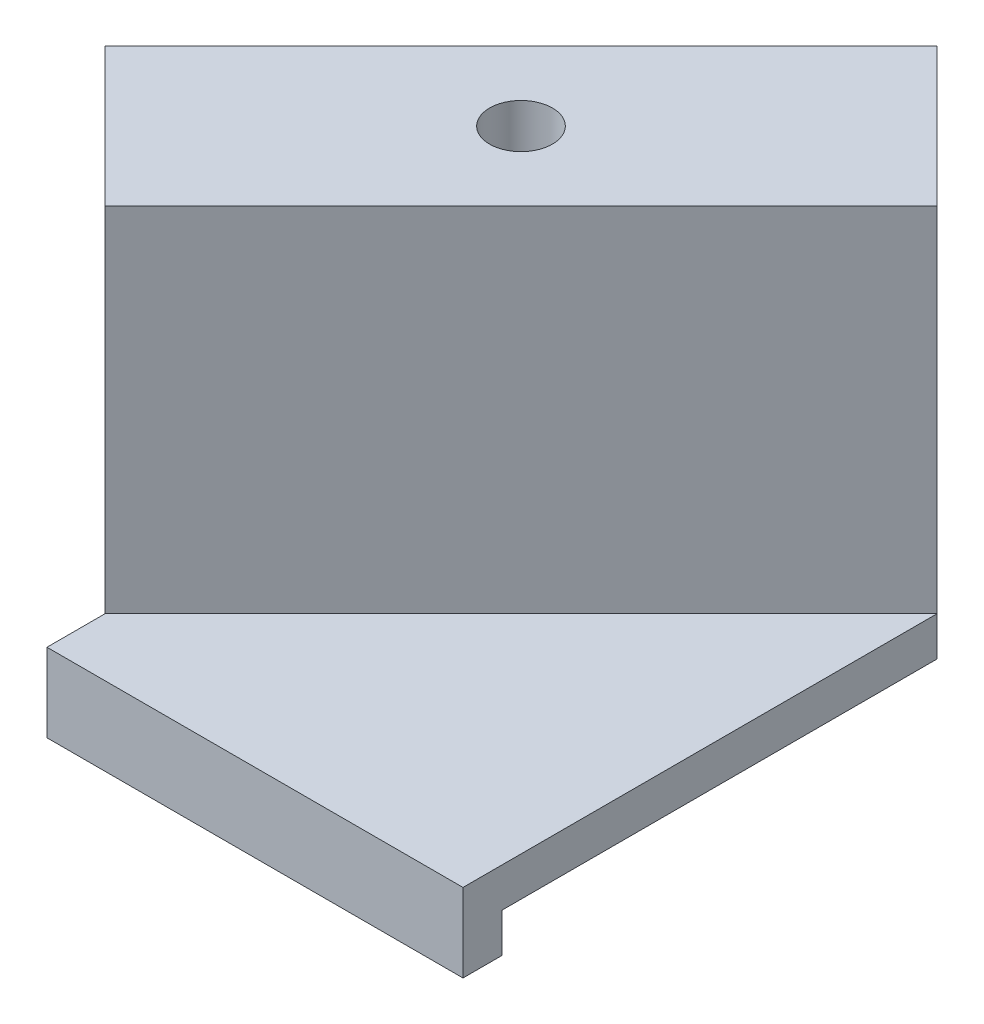
ISO-10303-21;
HEADER;
FILE_DESCRIPTION(('STEP AP214'),'2;1');
FILE_NAME('part.step','',(''),(''),'','','');
FILE_SCHEMA(('AUTOMOTIVE_DESIGN { 1 0 10303 214 1 1 1 1 }'));
ENDSEC;
DATA;
#1=APPLICATION_CONTEXT('core data for automotive mechanical design processes');
#2=APPLICATION_PROTOCOL_DEFINITION('international standard','automotive_design',2000,#1);
#3=PRODUCT_CONTEXT('',#1,'mechanical');
#4=PRODUCT('Part','Part','',(#3));
#5=PRODUCT_RELATED_PRODUCT_CATEGORY('part','',(#4));
#6=PRODUCT_DEFINITION_FORMATION('','',#4);
#7=PRODUCT_DEFINITION_CONTEXT('part definition',#1,'design');
#8=PRODUCT_DEFINITION('design','',#6,#7);
#9=PRODUCT_DEFINITION_SHAPE('','',#8);
#10=(LENGTH_UNIT() NAMED_UNIT(*) SI_UNIT(.MILLI.,.METRE.));
#11=(NAMED_UNIT(*) PLANE_ANGLE_UNIT() SI_UNIT($,.RADIAN.));
#12=(NAMED_UNIT(*) SI_UNIT($,.STERADIAN.) SOLID_ANGLE_UNIT());
#13=UNCERTAINTY_MEASURE_WITH_UNIT(LENGTH_MEASURE(1.E-05),#10,'distance_accuracy_value','');
#14=(GEOMETRIC_REPRESENTATION_CONTEXT(3) GLOBAL_UNCERTAINTY_ASSIGNED_CONTEXT((#13)) GLOBAL_UNIT_ASSIGNED_CONTEXT((#10,
#11,#12)) REPRESENTATION_CONTEXT('',''));
#15=CARTESIAN_POINT('',(0.,0.,0.));
#16=DIRECTION('',(0.,0.,1.));
#17=DIRECTION('',(1.,0.,0.));
#18=AXIS2_PLACEMENT_3D('',#15,#16,#17);
#19=CARTESIAN_POINT('',(3.53553390593275,20.,3.53553390593273));
#20=DIRECTION('',(-0.707106781186549,0.,-0.707106781186546));
#21=DIRECTION('',(-0.707106781186546,0.,0.707106781186549));
#22=AXIS2_PLACEMENT_3D('',#19,#20,#21);
#23=PLANE('',#22);
#24=DIRECTION('',(0.,-1.,0.));
#25=VECTOR('',#24,1.);
#26=CARTESIAN_POINT('',(-7.07106781186545,20.,14.142135623731));
#27=LINE('',#26,#25);
#28=CARTESIAN_POINT('',(-7.07106781186545,20.,14.142135623731));
#29=VERTEX_POINT('',#28);
#30=CARTESIAN_POINT('',(-7.07106781186545,2.,14.142135623731));
#31=VERTEX_POINT('',#30);
#32=EDGE_CURVE('E210',#29,#31,#27,.T.);
#33=ORIENTED_EDGE('',*,*,#32,.T.);
#34=DIRECTION('',(0.707106781186546,0.,-0.707106781186549));
#35=VECTOR('',#34,1.);
#36=CARTESIAN_POINT('',(3.53553390593275,2.,3.53553390593273));
#37=LINE('',#36,#35);
#38=CARTESIAN_POINT('',(14.1421356237309,2.,-7.0710678118655));
#39=VERTEX_POINT('',#38);
#40=EDGE_CURVE('E61',#31,#39,#37,.T.);
#41=ORIENTED_EDGE('',*,*,#40,.T.);
#42=DIRECTION('',(0.,-1.,0.));
#43=VECTOR('',#42,1.);
#44=CARTESIAN_POINT('',(14.1421356237309,20.,-7.0710678118655));
#45=LINE('',#44,#43);
#46=CARTESIAN_POINT('',(14.1421356237309,20.,-7.0710678118655));
#47=VERTEX_POINT('',#46);
#48=EDGE_CURVE('E11',#47,#39,#45,.T.);
#49=ORIENTED_EDGE('',*,*,#48,.F.);
#50=DIRECTION('',(0.707106781186546,0.,-0.707106781186549));
#51=VECTOR('',#50,1.);
#52=CARTESIAN_POINT('',(3.53553390593275,20.,3.53553390593273));
#53=LINE('',#52,#51);
#54=EDGE_CURVE('E194',#29,#47,#53,.T.);
#55=ORIENTED_EDGE('',*,*,#54,.F.);
#56=EDGE_LOOP('',(#33,#41,#49,#55));
#57=FACE_BOUND('',#56,.T.);
#58=ADVANCED_FACE('F45',(#57),#23,.F.);
#59=CARTESIAN_POINT('',(10.6066017177982,20.,-10.6066017177982));
#60=DIRECTION('',(-0.707106781186546,0.,0.707106781186549));
#61=DIRECTION('',(0.707106781186549,0.,0.707106781186546));
#62=AXIS2_PLACEMENT_3D('',#59,#60,#61);
#63=PLANE('',#62);
#64=DIRECTION('',(-0.707106781186549,0.,-0.707106781186546));
#65=VECTOR('',#64,1.);
#66=CARTESIAN_POINT('',(10.6066017177982,0.,-10.6066017177982));
#67=LINE('',#66,#65);
#68=CARTESIAN_POINT('',(14.1421356237309,0.,-7.0710678118655));
#69=VERTEX_POINT('',#68);
#70=CARTESIAN_POINT('',(7.07106781186545,0.,-14.142135623731));
#71=VERTEX_POINT('',#70);
#72=EDGE_CURVE('E214',#69,#71,#67,.T.);
#73=ORIENTED_EDGE('',*,*,#72,.T.);
#74=DIRECTION('',(0.,-1.,0.));
#75=VECTOR('',#74,1.);
#76=CARTESIAN_POINT('',(7.07106781186545,20.,-14.142135623731));
#77=LINE('',#76,#75);
#78=CARTESIAN_POINT('',(7.07106781186545,20.,-14.142135623731));
#79=VERTEX_POINT('',#78);
#80=EDGE_CURVE('E54',#79,#71,#77,.T.);
#81=ORIENTED_EDGE('',*,*,#80,.F.);
#82=DIRECTION('',(-0.707106781186549,0.,-0.707106781186546));
#83=VECTOR('',#82,1.);
#84=CARTESIAN_POINT('',(10.6066017177982,20.,-10.6066017177982));
#85=LINE('',#84,#83);
#86=EDGE_CURVE('E199',#47,#79,#85,.T.);
#87=ORIENTED_EDGE('',*,*,#86,.F.);
#88=ORIENTED_EDGE('',*,*,#48,.T.);
#89=DIRECTION('',(0.,-1.,0.));
#90=VECTOR('',#89,1.);
#91=CARTESIAN_POINT('',(14.1421356237309,2.,-7.0710678118655));
#92=LINE('',#91,#90);
#93=EDGE_CURVE('E125',#39,#69,#92,.T.);
#94=ORIENTED_EDGE('',*,*,#93,.T.);
#95=EDGE_LOOP('',(#73,#81,#87,#88,#94));
#96=FACE_BOUND('',#95,.T.);
#97=ADVANCED_FACE('F236',(#96),#63,.F.);
#98=CARTESIAN_POINT('',(-3.53553390593274,20.,-3.53553390593273));
#99=DIRECTION('',(-0.707106781186549,0.,-0.707106781186546));
#100=DIRECTION('',(-0.707106781186546,0.,0.707106781186549));
#101=AXIS2_PLACEMENT_3D('',#98,#99,#100);
#102=PLANE('',#101);
#103=DIRECTION('',(0.707106781186546,0.,-0.707106781186549));
#104=VECTOR('',#103,1.);
#105=CARTESIAN_POINT('',(-3.53553390593274,0.,-3.53553390593273));
#106=LINE('',#105,#104);
#107=CARTESIAN_POINT('',(-14.1421356237309,0.,7.07106781186551));
#108=VERTEX_POINT('',#107);
#109=EDGE_CURVE('E218',#108,#71,#106,.T.);
#110=ORIENTED_EDGE('',*,*,#109,.F.);
#111=DIRECTION('',(0.,-1.,0.));
#112=VECTOR('',#111,1.);
#113=CARTESIAN_POINT('',(-14.1421356237309,20.,7.07106781186551));
#114=LINE('',#113,#112);
#115=CARTESIAN_POINT('',(-14.1421356237309,20.,7.07106781186551));
#116=VERTEX_POINT('',#115);
#117=EDGE_CURVE('E227',#116,#108,#114,.T.);
#118=ORIENTED_EDGE('',*,*,#117,.F.);
#119=DIRECTION('',(0.707106781186546,0.,-0.707106781186549));
#120=VECTOR('',#119,1.);
#121=CARTESIAN_POINT('',(-3.53553390593274,20.,-3.53553390593273));
#122=LINE('',#121,#120);
#123=EDGE_CURVE('E202',#116,#79,#122,.T.);
#124=ORIENTED_EDGE('',*,*,#123,.T.);
#125=ORIENTED_EDGE('',*,*,#80,.T.);
#126=EDGE_LOOP('',(#110,#118,#124,#125));
#127=FACE_BOUND('',#126,.T.);
#128=ADVANCED_FACE('F233',(#127),#102,.T.);
#129=CARTESIAN_POINT('',(0.,20.,0.));
#130=DIRECTION('',(0.,-1.,0.));
#131=DIRECTION('',(0.,0.,-1.));
#132=AXIS2_PLACEMENT_3D('',#129,#130,#131);
#133=CYLINDRICAL_SURFACE('',#132,1.6);
#134=CARTESIAN_POINT('',(0.,20.,0.));
#135=DIRECTION('',(0.,1.,0.));
#136=DIRECTION('',(0.,0.,1.));
#137=AXIS2_PLACEMENT_3D('',#134,#135,#136);
#138=CIRCLE('',#137,1.6);
#139=CARTESIAN_POINT('',(0.,20.,1.6));
#140=VERTEX_POINT('',#139);
#141=EDGE_CURVE('E190',#140,#140,#138,.T.);
#142=ORIENTED_EDGE('',*,*,#141,.T.);
#143=EDGE_LOOP('',(#142));
#144=FACE_BOUND('',#143,.T.);
#145=CARTESIAN_POINT('',(0.,0.,0.));
#146=DIRECTION('',(0.,1.,0.));
#147=DIRECTION('',(0.,0.,1.));
#148=AXIS2_PLACEMENT_3D('',#145,#146,#147);
#149=CIRCLE('',#148,1.6);
#150=CARTESIAN_POINT('',(0.,0.,1.6));
#151=VERTEX_POINT('',#150);
#152=EDGE_CURVE('E189',#151,#151,#149,.T.);
#153=ORIENTED_EDGE('',*,*,#152,.F.);
#154=EDGE_LOOP('',(#153));
#155=FACE_BOUND('',#154,.T.);
#156=ADVANCED_FACE('F47',(#144,#155),#133,.F.);
#157=CARTESIAN_POINT('',(-10.6066017177982,20.,10.6066017177982));
#158=DIRECTION('',(-0.707106781186546,0.,0.707106781186549));
#159=DIRECTION('',(0.707106781186549,0.,0.707106781186546));
#160=AXIS2_PLACEMENT_3D('',#157,#158,#159);
#161=PLANE('',#160);
#162=DIRECTION('',(-0.707106781186549,0.,-0.707106781186546));
#163=VECTOR('',#162,1.);
#164=CARTESIAN_POINT('',(-10.6066017177982,0.,10.6066017177982));
#165=LINE('',#164,#163);
#166=CARTESIAN_POINT('',(-7.07106781186545,0.,14.142135623731));
#167=VERTEX_POINT('',#166);
#168=EDGE_CURVE('E195',#167,#108,#165,.T.);
#169=ORIENTED_EDGE('',*,*,#168,.F.);
#170=DIRECTION('',(0.,-1.,0.));
#171=VECTOR('',#170,1.);
#172=CARTESIAN_POINT('',(-7.07106781186545,2.,14.142135623731));
#173=LINE('',#172,#171);
#174=EDGE_CURVE('E68',#31,#167,#173,.T.);
#175=ORIENTED_EDGE('',*,*,#174,.F.);
#176=ORIENTED_EDGE('',*,*,#32,.F.);
#177=DIRECTION('',(-0.707106781186549,0.,-0.707106781186546));
#178=VECTOR('',#177,1.);
#179=CARTESIAN_POINT('',(-10.6066017177982,20.,10.6066017177982));
#180=LINE('',#179,#178);
#181=EDGE_CURVE('E206',#29,#116,#180,.T.);
#182=ORIENTED_EDGE('',*,*,#181,.T.);
#183=ORIENTED_EDGE('',*,*,#117,.T.);
#184=EDGE_LOOP('',(#169,#175,#176,#182,#183));
#185=FACE_BOUND('',#184,.T.);
#186=ADVANCED_FACE('F240',(#185),#161,.T.);
#187=CARTESIAN_POINT('',(0.,20.,0.));
#188=DIRECTION('',(0.,1.,0.));
#189=DIRECTION('',(0.,0.,1.));
#190=AXIS2_PLACEMENT_3D('',#187,#188,#189);
#191=PLANE('',#190);
#192=ORIENTED_EDGE('',*,*,#141,.F.);
#193=EDGE_LOOP('',(#192));
#194=FACE_BOUND('',#193,.T.);
#195=ORIENTED_EDGE('',*,*,#54,.T.);
#196=ORIENTED_EDGE('',*,*,#86,.T.);
#197=ORIENTED_EDGE('',*,*,#123,.F.);
#198=ORIENTED_EDGE('',*,*,#181,.F.);
#199=EDGE_LOOP('',(#195,#196,#197,#198));
#200=FACE_BOUND('',#199,.T.);
#201=ADVANCED_FACE('F268',(#194,#200),#191,.T.);
#202=CARTESIAN_POINT('',(0.,0.,0.));
#203=DIRECTION('',(0.,1.,0.));
#204=DIRECTION('',(0.,0.,1.));
#205=AXIS2_PLACEMENT_3D('',#202,#203,#204);
#206=PLANE('',#205);
#207=ORIENTED_EDGE('',*,*,#152,.T.);
#208=EDGE_LOOP('',(#207));
#209=FACE_BOUND('',#208,.T.);
#210=ORIENTED_EDGE('',*,*,#72,.F.);
#211=DIRECTION('',(0.,0.,1.));
#212=VECTOR('',#211,1.);
#213=CARTESIAN_POINT('',(14.1421356237309,0.,0.));
#214=LINE('',#213,#212);
#215=CARTESIAN_POINT('',(14.1421356237309,0.,15.1));
#216=VERTEX_POINT('',#215);
#217=EDGE_CURVE('E172',#69,#216,#214,.T.);
#218=ORIENTED_EDGE('',*,*,#217,.T.);
#219=DIRECTION('',(-1.,0.,0.));
#220=VECTOR('',#219,1.);
#221=CARTESIAN_POINT('',(0.,0.,15.1));
#222=LINE('',#221,#220);
#223=CARTESIAN_POINT('',(-7.07106781186545,0.,15.1));
#224=VERTEX_POINT('',#223);
#225=EDGE_CURVE('E178',#216,#224,#222,.T.);
#226=ORIENTED_EDGE('',*,*,#225,.T.);
#227=DIRECTION('',(0.,0.,1.));
#228=VECTOR('',#227,1.);
#229=CARTESIAN_POINT('',(-7.07106781186545,0.,0.));
#230=LINE('',#229,#228);
#231=EDGE_CURVE('E163',#167,#224,#230,.T.);
#232=ORIENTED_EDGE('',*,*,#231,.F.);
#233=ORIENTED_EDGE('',*,*,#168,.T.);
#234=ORIENTED_EDGE('',*,*,#109,.T.);
#235=EDGE_LOOP('',(#210,#218,#226,#232,#233,#234));
#236=FACE_BOUND('',#235,.T.);
#237=ADVANCED_FACE('F238',(#209,#236),#206,.F.);
#238=CARTESIAN_POINT('',(-7.07106781186545,2.,0.));
#239=DIRECTION('',(1.,0.,0.));
#240=DIRECTION('',(0.,0.,-1.));
#241=AXIS2_PLACEMENT_3D('',#238,#239,#240);
#242=PLANE('',#241);
#243=ORIENTED_EDGE('',*,*,#231,.T.);
#244=DIRECTION('',(0.,1.,0.));
#245=VECTOR('',#244,1.);
#246=CARTESIAN_POINT('',(-7.07106781186545,-2.,15.1));
#247=LINE('',#246,#245);
#248=CARTESIAN_POINT('',(-7.07106781186545,-2.,15.1));
#249=VERTEX_POINT('',#248);
#250=EDGE_CURVE('E164',#249,#224,#247,.T.);
#251=ORIENTED_EDGE('',*,*,#250,.F.);
#252=DIRECTION('',(0.,0.,1.));
#253=VECTOR('',#252,1.);
#254=CARTESIAN_POINT('',(-7.07106781186545,-2.,0.));
#255=LINE('',#254,#253);
#256=CARTESIAN_POINT('',(-7.07106781186545,-2.,17.1));
#257=VERTEX_POINT('',#256);
#258=EDGE_CURVE('E140',#249,#257,#255,.T.);
#259=ORIENTED_EDGE('',*,*,#258,.T.);
#260=DIRECTION('',(0.,1.,0.));
#261=VECTOR('',#260,1.);
#262=CARTESIAN_POINT('',(-7.07106781186545,-2.,17.1));
#263=LINE('',#262,#261);
#264=CARTESIAN_POINT('',(-7.07106781186545,2.,17.1));
#265=VERTEX_POINT('',#264);
#266=EDGE_CURVE('E160',#257,#265,#263,.T.);
#267=ORIENTED_EDGE('',*,*,#266,.T.);
#268=DIRECTION('',(0.,0.,1.));
#269=VECTOR('',#268,1.);
#270=CARTESIAN_POINT('',(-7.07106781186545,2.,0.));
#271=LINE('',#270,#269);
#272=EDGE_CURVE('E129',#31,#265,#271,.T.);
#273=ORIENTED_EDGE('',*,*,#272,.F.);
#274=ORIENTED_EDGE('',*,*,#174,.T.);
#275=EDGE_LOOP('',(#243,#251,#259,#267,#273,#274));
#276=FACE_BOUND('',#275,.T.);
#277=ADVANCED_FACE('F242',(#276),#242,.F.);
#278=CARTESIAN_POINT('',(14.1421356237309,2.,0.));
#279=DIRECTION('',(1.,0.,0.));
#280=DIRECTION('',(0.,0.,-1.));
#281=AXIS2_PLACEMENT_3D('',#278,#279,#280);
#282=PLANE('',#281);
#283=ORIENTED_EDGE('',*,*,#217,.F.);
#284=ORIENTED_EDGE('',*,*,#93,.F.);
#285=DIRECTION('',(0.,0.,1.));
#286=VECTOR('',#285,1.);
#287=CARTESIAN_POINT('',(14.1421356237309,2.,0.));
#288=LINE('',#287,#286);
#289=CARTESIAN_POINT('',(14.1421356237309,2.,17.1));
#290=VERTEX_POINT('',#289);
#291=EDGE_CURVE('E117',#39,#290,#288,.T.);
#292=ORIENTED_EDGE('',*,*,#291,.T.);
#293=DIRECTION('',(0.,1.,0.));
#294=VECTOR('',#293,1.);
#295=CARTESIAN_POINT('',(14.1421356237309,-2.,17.1));
#296=LINE('',#295,#294);
#297=CARTESIAN_POINT('',(14.1421356237309,-2.,17.1));
#298=VERTEX_POINT('',#297);
#299=EDGE_CURVE('E122',#298,#290,#296,.T.);
#300=ORIENTED_EDGE('',*,*,#299,.F.);
#301=DIRECTION('',(0.,0.,-1.));
#302=VECTOR('',#301,1.);
#303=CARTESIAN_POINT('',(14.1421356237309,-2.,0.));
#304=LINE('',#303,#302);
#305=CARTESIAN_POINT('',(14.1421356237309,-2.,15.1));
#306=VERTEX_POINT('',#305);
#307=EDGE_CURVE('E148',#298,#306,#304,.T.);
#308=ORIENTED_EDGE('',*,*,#307,.T.);
#309=DIRECTION('',(0.,1.,0.));
#310=VECTOR('',#309,1.);
#311=CARTESIAN_POINT('',(14.1421356237309,-2.,15.1));
#312=LINE('',#311,#310);
#313=EDGE_CURVE('E139',#306,#216,#312,.T.);
#314=ORIENTED_EDGE('',*,*,#313,.T.);
#315=EDGE_LOOP('',(#283,#284,#292,#300,#308,#314));
#316=FACE_BOUND('',#315,.T.);
#317=ADVANCED_FACE('F120',(#316),#282,.T.);
#318=CARTESIAN_POINT('',(0.,2.,0.));
#319=DIRECTION('',(0.,1.,0.));
#320=DIRECTION('',(0.,0.,1.));
#321=AXIS2_PLACEMENT_3D('',#318,#319,#320);
#322=PLANE('',#321);
#323=ORIENTED_EDGE('',*,*,#40,.F.);
#324=ORIENTED_EDGE('',*,*,#272,.T.);
#325=DIRECTION('',(1.,0.,0.));
#326=VECTOR('',#325,1.);
#327=CARTESIAN_POINT('',(0.,2.,17.1));
#328=LINE('',#327,#326);
#329=EDGE_CURVE('E135',#265,#290,#328,.T.);
#330=ORIENTED_EDGE('',*,*,#329,.T.);
#331=ORIENTED_EDGE('',*,*,#291,.F.);
#332=EDGE_LOOP('',(#323,#324,#330,#331));
#333=FACE_BOUND('',#332,.T.);
#334=ADVANCED_FACE('F142',(#333),#322,.T.);
#335=CARTESIAN_POINT('',(0.,-2.,15.1));
#336=DIRECTION('',(0.,0.,-1.));
#337=DIRECTION('',(-1.,0.,0.));
#338=AXIS2_PLACEMENT_3D('',#335,#336,#337);
#339=PLANE('',#338);
#340=ORIENTED_EDGE('',*,*,#225,.F.);
#341=ORIENTED_EDGE('',*,*,#313,.F.);
#342=DIRECTION('',(-1.,0.,0.));
#343=VECTOR('',#342,1.);
#344=CARTESIAN_POINT('',(0.,-2.,15.1));
#345=LINE('',#344,#343);
#346=EDGE_CURVE('E153',#306,#249,#345,.T.);
#347=ORIENTED_EDGE('',*,*,#346,.T.);
#348=ORIENTED_EDGE('',*,*,#250,.T.);
#349=EDGE_LOOP('',(#340,#341,#347,#348));
#350=FACE_BOUND('',#349,.T.);
#351=ADVANCED_FACE('F248',(#350),#339,.T.);
#352=CARTESIAN_POINT('',(0.,-2.,17.1));
#353=DIRECTION('',(0.,0.,1.));
#354=DIRECTION('',(1.,0.,0.));
#355=AXIS2_PLACEMENT_3D('',#352,#353,#354);
#356=PLANE('',#355);
#357=ORIENTED_EDGE('',*,*,#299,.T.);
#358=ORIENTED_EDGE('',*,*,#329,.F.);
#359=ORIENTED_EDGE('',*,*,#266,.F.);
#360=DIRECTION('',(1.,0.,0.));
#361=VECTOR('',#360,1.);
#362=CARTESIAN_POINT('',(0.,-2.,17.1));
#363=LINE('',#362,#361);
#364=EDGE_CURVE('E137',#257,#298,#363,.T.);
#365=ORIENTED_EDGE('',*,*,#364,.T.);
#366=EDGE_LOOP('',(#357,#358,#359,#365));
#367=FACE_BOUND('',#366,.T.);
#368=ADVANCED_FACE('F134',(#367),#356,.T.);
#369=CARTESIAN_POINT('',(0.,-2.,0.));
#370=DIRECTION('',(0.,1.,0.));
#371=DIRECTION('',(0.,0.,1.));
#372=AXIS2_PLACEMENT_3D('',#369,#370,#371);
#373=PLANE('',#372);
#374=ORIENTED_EDGE('',*,*,#364,.F.);
#375=ORIENTED_EDGE('',*,*,#258,.F.);
#376=ORIENTED_EDGE('',*,*,#346,.F.);
#377=ORIENTED_EDGE('',*,*,#307,.F.);
#378=EDGE_LOOP('',(#374,#375,#376,#377));
#379=FACE_BOUND('',#378,.T.);
#380=ADVANCED_FACE('F245',(#379),#373,.F.);
#381=CLOSED_SHELL('',(#58,#97,#128,#156,#186,#201,#237,#277,#317,#334,#351,#368,#380));
#382=MANIFOLD_SOLID_BREP('B2',#381);
#383=ADVANCED_BREP_SHAPE_REPRESENTATION('',(#18,#382),#14);
#384=SHAPE_DEFINITION_REPRESENTATION(#9,#383);
ENDSEC;
END-ISO-10303-21;
